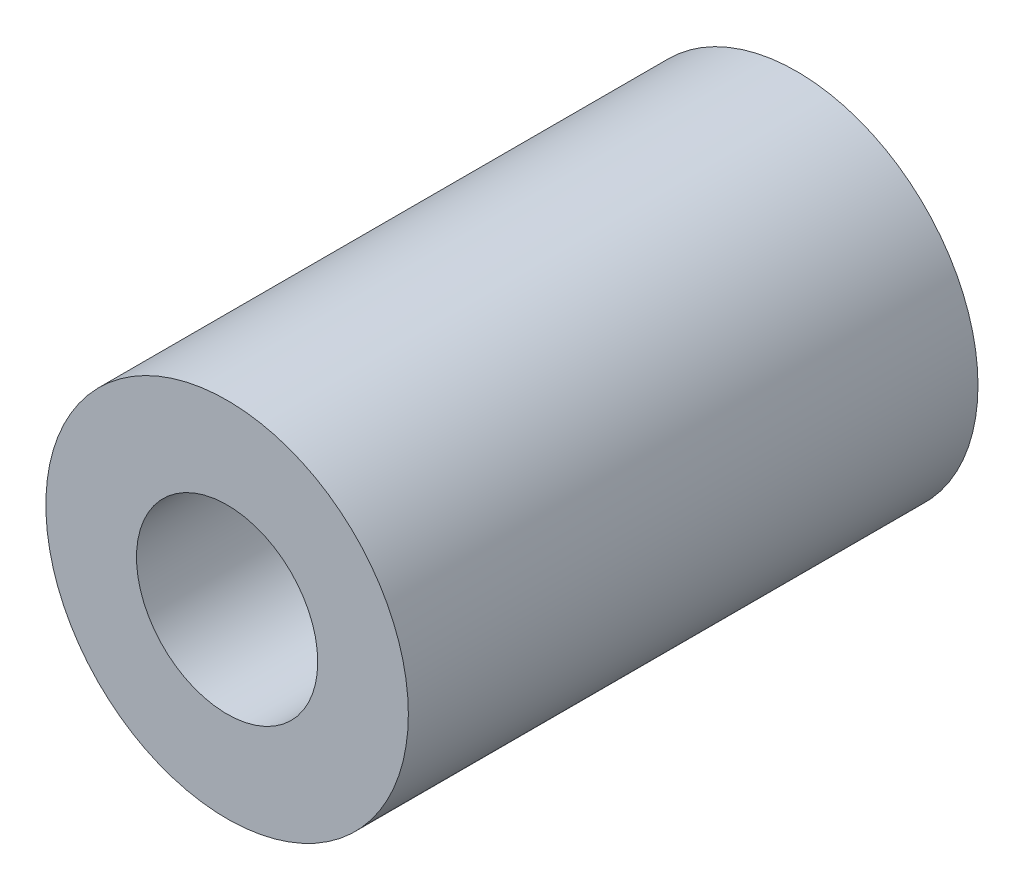
ISO-10303-21;
HEADER;
FILE_DESCRIPTION(('STEP AP214'),'2;1');
FILE_NAME('part.step','',(''),(''),'','','');
FILE_SCHEMA(('AUTOMOTIVE_DESIGN { 1 0 10303 214 1 1 1 1 }'));
ENDSEC;
DATA;
#1=APPLICATION_CONTEXT('core data for automotive mechanical design processes');
#2=APPLICATION_PROTOCOL_DEFINITION('international standard','automotive_design',2000,#1);
#3=PRODUCT_CONTEXT('',#1,'mechanical');
#4=PRODUCT('Part','Part','',(#3));
#5=PRODUCT_RELATED_PRODUCT_CATEGORY('part','',(#4));
#6=PRODUCT_DEFINITION_FORMATION('','',#4);
#7=PRODUCT_DEFINITION_CONTEXT('part definition',#1,'design');
#8=PRODUCT_DEFINITION('design','',#6,#7);
#9=PRODUCT_DEFINITION_SHAPE('','',#8);
#10=(LENGTH_UNIT() NAMED_UNIT(*) SI_UNIT(.MILLI.,.METRE.));
#11=(NAMED_UNIT(*) PLANE_ANGLE_UNIT() SI_UNIT($,.RADIAN.));
#12=(NAMED_UNIT(*) SI_UNIT($,.STERADIAN.) SOLID_ANGLE_UNIT());
#13=UNCERTAINTY_MEASURE_WITH_UNIT(LENGTH_MEASURE(1.E-05),#10,'distance_accuracy_value','');
#14=(GEOMETRIC_REPRESENTATION_CONTEXT(3) GLOBAL_UNCERTAINTY_ASSIGNED_CONTEXT((#13)) GLOBAL_UNIT_ASSIGNED_CONTEXT((#10,
#11,#12)) REPRESENTATION_CONTEXT('',''));
#15=CARTESIAN_POINT('',(0.,0.,0.));
#16=DIRECTION('',(0.,0.,1.));
#17=DIRECTION('',(1.,0.,0.));
#18=AXIS2_PLACEMENT_3D('',#15,#16,#17);
#19=CARTESIAN_POINT('',(0.,0.,0.));
#20=DIRECTION('',(0.,0.,1.));
#21=DIRECTION('',(1.,0.,0.));
#22=AXIS2_PLACEMENT_3D('',#19,#20,#21);
#23=CYLINDRICAL_SURFACE('',#22,3.);
#24=CARTESIAN_POINT('',(0.,0.,0.));
#25=DIRECTION('',(0.,0.,1.));
#26=DIRECTION('',(1.,0.,0.));
#27=AXIS2_PLACEMENT_3D('',#24,#25,#26);
#28=CIRCLE('',#27,3.);
#29=CARTESIAN_POINT('',(3.,0.,0.));
#30=VERTEX_POINT('',#29);
#31=EDGE_CURVE('E46',#30,#30,#28,.T.);
#32=ORIENTED_EDGE('',*,*,#31,.F.);
#33=EDGE_LOOP('',(#32));
#34=FACE_BOUND('',#33,.T.);
#35=CARTESIAN_POINT('',(0.,0.,15.));
#36=DIRECTION('',(0.,0.,1.));
#37=DIRECTION('',(1.,0.,0.));
#38=AXIS2_PLACEMENT_3D('',#35,#36,#37);
#39=CIRCLE('',#38,3.);
#40=CARTESIAN_POINT('',(3.,0.,15.));
#41=VERTEX_POINT('',#40);
#42=EDGE_CURVE('E37',#41,#41,#39,.F.);
#43=ORIENTED_EDGE('',*,*,#42,.F.);
#44=EDGE_LOOP('',(#43));
#45=FACE_BOUND('',#44,.T.);
#46=ADVANCED_FACE('F33',(#34,#45),#23,.F.);
#47=CARTESIAN_POINT('',(0.,0.,22.));
#48=DIRECTION('',(0.,0.,-1.));
#49=DIRECTION('',(-1.,0.,0.));
#50=AXIS2_PLACEMENT_3D('',#47,#48,#49);
#51=CYLINDRICAL_SURFACE('',#50,7.);
#52=CARTESIAN_POINT('',(0.,0.,22.));
#53=DIRECTION('',(0.,0.,1.));
#54=DIRECTION('',(1.,0.,0.));
#55=AXIS2_PLACEMENT_3D('',#52,#53,#54);
#56=CIRCLE('',#55,7.);
#57=CARTESIAN_POINT('',(7.,0.,22.));
#58=VERTEX_POINT('',#57);
#59=EDGE_CURVE('E10',#58,#58,#56,.T.);
#60=ORIENTED_EDGE('',*,*,#59,.F.);
#61=EDGE_LOOP('',(#60));
#62=FACE_BOUND('',#61,.T.);
#63=CARTESIAN_POINT('',(0.,0.,0.));
#64=DIRECTION('',(0.,0.,1.));
#65=DIRECTION('',(1.,0.,0.));
#66=AXIS2_PLACEMENT_3D('',#63,#64,#65);
#67=CIRCLE('',#66,7.);
#68=CARTESIAN_POINT('',(7.,0.,0.));
#69=VERTEX_POINT('',#68);
#70=EDGE_CURVE('E41',#69,#69,#67,.T.);
#71=ORIENTED_EDGE('',*,*,#70,.T.);
#72=EDGE_LOOP('',(#71));
#73=FACE_BOUND('',#72,.T.);
#74=ADVANCED_FACE('F35',(#62,#73),#51,.T.);
#75=CARTESIAN_POINT('',(0.,0.,22.));
#76=DIRECTION('',(0.,0.,1.));
#77=DIRECTION('',(1.,0.,0.));
#78=AXIS2_PLACEMENT_3D('',#75,#76,#77);
#79=PLANE('',#78);
#80=CARTESIAN_POINT('',(0.,0.,22.));
#81=DIRECTION('',(0.,0.,1.));
#82=DIRECTION('',(1.,0.,0.));
#83=AXIS2_PLACEMENT_3D('',#80,#81,#82);
#84=CIRCLE('',#83,3.5);
#85=CARTESIAN_POINT('',(3.5,0.,22.));
#86=VERTEX_POINT('',#85);
#87=EDGE_CURVE('E50',#86,#86,#84,.T.);
#88=ORIENTED_EDGE('',*,*,#87,.F.);
#89=EDGE_LOOP('',(#88));
#90=FACE_BOUND('',#89,.T.);
#91=ORIENTED_EDGE('',*,*,#59,.T.);
#92=EDGE_LOOP('',(#91));
#93=FACE_BOUND('',#92,.T.);
#94=ADVANCED_FACE('F68',(#90,#93),#79,.T.);
#95=CARTESIAN_POINT('',(0.,0.,0.));
#96=DIRECTION('',(0.,0.,1.));
#97=DIRECTION('',(1.,0.,0.));
#98=AXIS2_PLACEMENT_3D('',#95,#96,#97);
#99=PLANE('',#98);
#100=ORIENTED_EDGE('',*,*,#31,.T.);
#101=EDGE_LOOP('',(#100));
#102=FACE_BOUND('',#101,.T.);
#103=ORIENTED_EDGE('',*,*,#70,.F.);
#104=EDGE_LOOP('',(#103));
#105=FACE_BOUND('',#104,.T.);
#106=ADVANCED_FACE('F76',(#102,#105),#99,.F.);
#107=CARTESIAN_POINT('',(0.,0.,15.));
#108=DIRECTION('',(0.,0.,1.));
#109=DIRECTION('',(1.,0.,0.));
#110=AXIS2_PLACEMENT_3D('',#107,#108,#109);
#111=PLANE('',#110);
#112=CARTESIAN_POINT('',(0.,0.,15.));
#113=DIRECTION('',(0.,0.,1.));
#114=DIRECTION('',(1.,0.,0.));
#115=AXIS2_PLACEMENT_3D('',#112,#113,#114);
#116=CIRCLE('',#115,3.5);
#117=CARTESIAN_POINT('',(3.5,0.,15.));
#118=VERTEX_POINT('',#117);
#119=EDGE_CURVE('E53',#118,#118,#116,.T.);
#120=ORIENTED_EDGE('',*,*,#119,.T.);
#121=EDGE_LOOP('',(#120));
#122=FACE_BOUND('',#121,.T.);
#123=ORIENTED_EDGE('',*,*,#42,.T.);
#124=EDGE_LOOP('',(#123));
#125=FACE_BOUND('',#124,.T.);
#126=ADVANCED_FACE('F60',(#122,#125),#111,.T.);
#127=CARTESIAN_POINT('',(0.,0.,15.));
#128=DIRECTION('',(0.,0.,1.));
#129=DIRECTION('',(1.,0.,0.));
#130=AXIS2_PLACEMENT_3D('',#127,#128,#129);
#131=CYLINDRICAL_SURFACE('',#130,3.5);
#132=ORIENTED_EDGE('',*,*,#119,.F.);
#133=EDGE_LOOP('',(#132));
#134=FACE_BOUND('',#133,.T.);
#135=ORIENTED_EDGE('',*,*,#87,.T.);
#136=EDGE_LOOP('',(#135));
#137=FACE_BOUND('',#136,.T.);
#138=ADVANCED_FACE('F73',(#134,#137),#131,.F.);
#139=CLOSED_SHELL('',(#46,#74,#94,#106,#126,#138));
#140=MANIFOLD_SOLID_BREP('B2',#139);
#141=ADVANCED_BREP_SHAPE_REPRESENTATION('',(#18,#140),#14);
#142=SHAPE_DEFINITION_REPRESENTATION(#9,#141);
ENDSEC;
END-ISO-10303-21;
